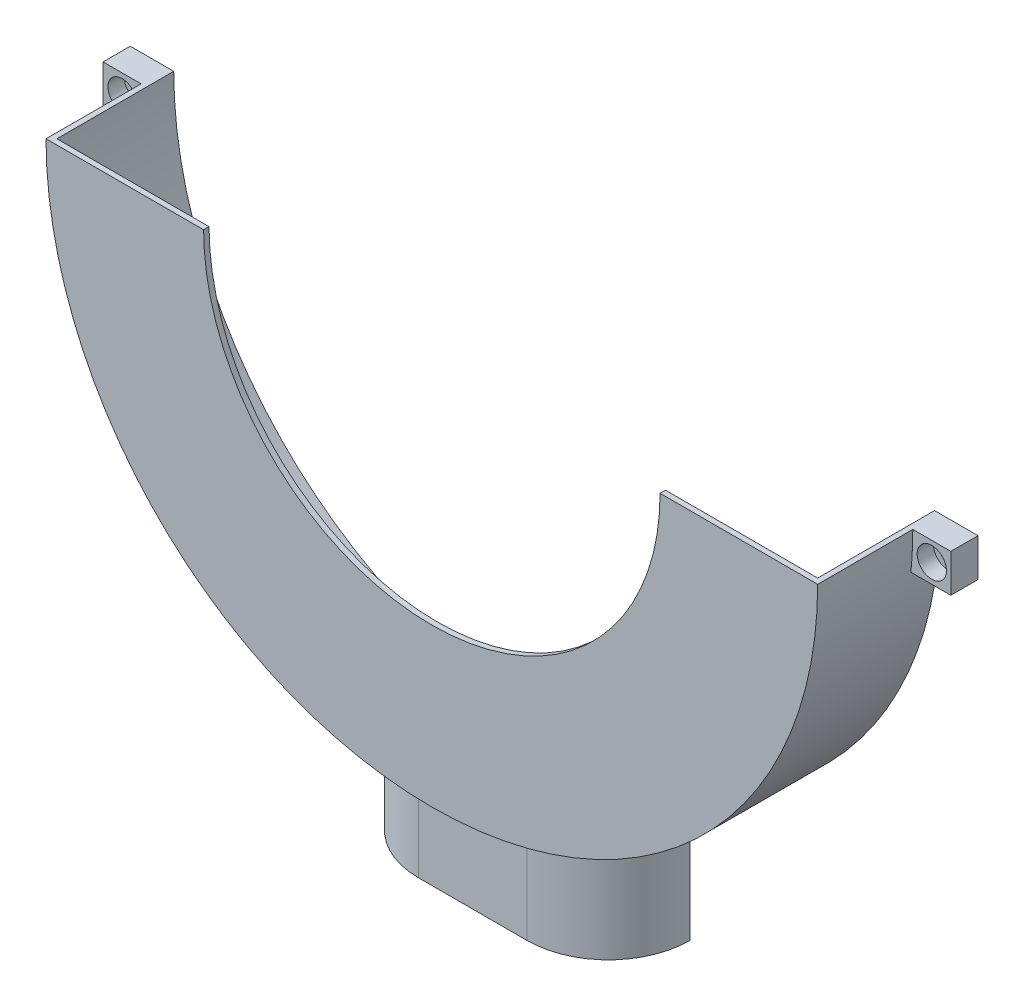
ISO-10303-21;
HEADER;
FILE_DESCRIPTION(('STEP AP214'),'2;1');
FILE_NAME('part.step','',(''),(''),'','','');
FILE_SCHEMA(('AUTOMOTIVE_DESIGN { 1 0 10303 214 1 1 1 1 }'));
ENDSEC;
DATA;
#1=APPLICATION_CONTEXT('core data for automotive mechanical design processes');
#2=APPLICATION_PROTOCOL_DEFINITION('international standard','automotive_design',2000,#1);
#3=PRODUCT_CONTEXT('',#1,'mechanical');
#4=PRODUCT('Part','Part','',(#3));
#5=PRODUCT_RELATED_PRODUCT_CATEGORY('part','',(#4));
#6=PRODUCT_DEFINITION_FORMATION('','',#4);
#7=PRODUCT_DEFINITION_CONTEXT('part definition',#1,'design');
#8=PRODUCT_DEFINITION('design','',#6,#7);
#9=PRODUCT_DEFINITION_SHAPE('','',#8);
#10=(LENGTH_UNIT() NAMED_UNIT(*) SI_UNIT(.MILLI.,.METRE.));
#11=(NAMED_UNIT(*) PLANE_ANGLE_UNIT() SI_UNIT($,.RADIAN.));
#12=(NAMED_UNIT(*) SI_UNIT($,.STERADIAN.) SOLID_ANGLE_UNIT());
#13=UNCERTAINTY_MEASURE_WITH_UNIT(LENGTH_MEASURE(1.E-05),#10,'distance_accuracy_value','');
#14=(GEOMETRIC_REPRESENTATION_CONTEXT(3) GLOBAL_UNCERTAINTY_ASSIGNED_CONTEXT((#13)) GLOBAL_UNIT_ASSIGNED_CONTEXT((#10,
#11,#12)) REPRESENTATION_CONTEXT('',''));
#15=CARTESIAN_POINT('',(0.,0.,0.));
#16=DIRECTION('',(0.,0.,1.));
#17=DIRECTION('',(1.,0.,0.));
#18=AXIS2_PLACEMENT_3D('',#15,#16,#17);
#19=CARTESIAN_POINT('',(0.,0.,0.));
#20=DIRECTION('',(0.,0.,1.));
#21=DIRECTION('',(1.,0.,0.));
#22=AXIS2_PLACEMENT_3D('',#19,#20,#21);
#23=PLANE('',#22);
#24=CARTESIAN_POINT('',(74.5,-3.49999999999999,0.));
#25=DIRECTION('',(0.,0.,-1.));
#26=DIRECTION('',(-1.,0.,0.));
#27=AXIS2_PLACEMENT_3D('',#24,#25,#26);
#28=CIRCLE('',#27,1.60000000000001);
#29=CARTESIAN_POINT('',(72.9,-3.49999999999999,0.));
#30=VERTEX_POINT('',#29);
#31=EDGE_CURVE('E336',#30,#30,#28,.T.);
#32=ORIENTED_EDGE('',*,*,#31,.F.);
#33=EDGE_LOOP('',(#32));
#34=FACE_BOUND('',#33,.T.);
#35=CARTESIAN_POINT('',(-74.5,-3.50000000000002,0.));
#36=DIRECTION('',(0.,0.,1.));
#37=DIRECTION('',(1.,0.,0.));
#38=AXIS2_PLACEMENT_3D('',#35,#36,#37);
#39=CIRCLE('',#38,1.60000000000001);
#40=CARTESIAN_POINT('',(-72.9,-3.50000000000002,0.));
#41=VERTEX_POINT('',#40);
#42=EDGE_CURVE('E354',#41,#41,#39,.T.);
#43=ORIENTED_EDGE('',*,*,#42,.T.);
#44=EDGE_LOOP('',(#43));
#45=FACE_BOUND('',#44,.T.);
#46=DIRECTION('',(0.,-1.,0.));
#47=VECTOR('',#46,1.);
#48=CARTESIAN_POINT('',(21.6189500386222,-71.,0.));
#49=LINE('',#48,#47);
#50=CARTESIAN_POINT('',(21.6189500386222,-71.,0.));
#51=VERTEX_POINT('',#50);
#52=CARTESIAN_POINT('',(21.6189500386222,-91.,0.));
#53=VERTEX_POINT('',#52);
#54=EDGE_CURVE('E302',#51,#53,#49,.T.);
#55=ORIENTED_EDGE('',*,*,#54,.F.);
#56=DIRECTION('',(1.,0.,0.));
#57=VECTOR('',#56,1.);
#58=CARTESIAN_POINT('',(0.,-71.,0.));
#59=LINE('',#58,#57);
#60=CARTESIAN_POINT('',(-21.6189500386223,-71.,0.));
#61=VERTEX_POINT('',#60);
#62=EDGE_CURVE('E268',#61,#51,#59,.T.);
#63=ORIENTED_EDGE('',*,*,#62,.F.);
#64=DIRECTION('',(0.,-1.,0.));
#65=VECTOR('',#64,1.);
#66=CARTESIAN_POINT('',(-21.6189500386223,-71.,0.));
#67=LINE('',#66,#65);
#68=CARTESIAN_POINT('',(-21.6189500386223,-91.,0.));
#69=VERTEX_POINT('',#68);
#70=EDGE_CURVE('E305',#61,#69,#67,.T.);
#71=ORIENTED_EDGE('',*,*,#70,.T.);
#72=DIRECTION('',(-1.,0.,0.));
#73=VECTOR('',#72,1.);
#74=CARTESIAN_POINT('',(0.,-91.,0.));
#75=LINE('',#74,#73);
#76=CARTESIAN_POINT('',(-25.,-91.,0.));
#77=VERTEX_POINT('',#76);
#78=EDGE_CURVE('E388',#69,#77,#75,.T.);
#79=ORIENTED_EDGE('',*,*,#78,.T.);
#80=DIRECTION('',(0.,1.,0.));
#81=VECTOR('',#80,1.);
#82=CARTESIAN_POINT('',(-25.,0.,0.));
#83=LINE('',#82,#81);
#84=CARTESIAN_POINT('',(-25.,-66.4529909033446,0.));
#85=VERTEX_POINT('',#84);
#86=EDGE_CURVE('E382',#77,#85,#83,.T.);
#87=ORIENTED_EDGE('',*,*,#86,.T.);
#88=CARTESIAN_POINT('',(0.,0.,0.));
#89=DIRECTION('',(0.,0.,1.));
#90=DIRECTION('',(1.,0.,0.));
#91=AXIS2_PLACEMENT_3D('',#88,#89,#90);
#92=CIRCLE('',#91,71.);
#93=CARTESIAN_POINT('',(-70.6540869306228,-7.00000000000003,0.));
#94=VERTEX_POINT('',#93);
#95=EDGE_CURVE('E428',#94,#85,#92,.T.);
#96=ORIENTED_EDGE('',*,*,#95,.F.);
#97=DIRECTION('',(1.,0.,0.));
#98=VECTOR('',#97,1.);
#99=CARTESIAN_POINT('',(-73.,-7.00000000000003,0.));
#100=LINE('',#99,#98);
#101=CARTESIAN_POINT('',(-78.,-7.00000000000003,0.));
#102=VERTEX_POINT('',#101);
#103=EDGE_CURVE('E363',#102,#94,#100,.T.);
#104=ORIENTED_EDGE('',*,*,#103,.F.);
#105=DIRECTION('',(0.,-1.,0.));
#106=VECTOR('',#105,1.);
#107=CARTESIAN_POINT('',(-78.,0.,0.));
#108=LINE('',#107,#106);
#109=CARTESIAN_POINT('',(-78.,0.,0.));
#110=VERTEX_POINT('',#109);
#111=EDGE_CURVE('E357',#110,#102,#108,.T.);
#112=ORIENTED_EDGE('',*,*,#111,.F.);
#113=DIRECTION('',(1.,0.,0.));
#114=VECTOR('',#113,1.);
#115=CARTESIAN_POINT('',(0.,0.,0.));
#116=LINE('',#115,#114);
#117=CARTESIAN_POINT('',(-70.,0.,0.));
#118=VERTEX_POINT('',#117);
#119=EDGE_CURVE('E424',#110,#118,#116,.T.);
#120=ORIENTED_EDGE('',*,*,#119,.T.);
#121=CARTESIAN_POINT('',(0.,0.,0.));
#122=DIRECTION('',(0.,0.,1.));
#123=DIRECTION('',(1.,0.,0.));
#124=AXIS2_PLACEMENT_3D('',#121,#122,#123);
#125=CIRCLE('',#124,70.);
#126=CARTESIAN_POINT('',(70.,0.,0.));
#127=VERTEX_POINT('',#126);
#128=EDGE_CURVE('E417',#118,#127,#125,.T.);
#129=ORIENTED_EDGE('',*,*,#128,.T.);
#130=CARTESIAN_POINT('',(78.,0.,0.));
#131=VERTEX_POINT('',#130);
#132=EDGE_CURVE('E422',#127,#131,#116,.T.);
#133=ORIENTED_EDGE('',*,*,#132,.T.);
#134=DIRECTION('',(0.,-1.,0.));
#135=VECTOR('',#134,1.);
#136=CARTESIAN_POINT('',(78.,0.,0.));
#137=LINE('',#136,#135);
#138=CARTESIAN_POINT('',(78.,-7.,0.));
#139=VERTEX_POINT('',#138);
#140=EDGE_CURVE('E329',#131,#139,#137,.T.);
#141=ORIENTED_EDGE('',*,*,#140,.T.);
#142=DIRECTION('',(-1.,0.,0.));
#143=VECTOR('',#142,1.);
#144=CARTESIAN_POINT('',(0.,-7.,0.));
#145=LINE('',#144,#143);
#146=CARTESIAN_POINT('',(70.6540869306228,-7.,0.));
#147=VERTEX_POINT('',#146);
#148=EDGE_CURVE('E339',#139,#147,#145,.T.);
#149=ORIENTED_EDGE('',*,*,#148,.T.);
#150=CARTESIAN_POINT('',(25.,-66.4529909033446,0.));
#151=VERTEX_POINT('',#150);
#152=EDGE_CURVE('E427',#151,#147,#92,.T.);
#153=ORIENTED_EDGE('',*,*,#152,.F.);
#154=DIRECTION('',(0.,1.,0.));
#155=VECTOR('',#154,1.);
#156=CARTESIAN_POINT('',(25.,0.,0.));
#157=LINE('',#156,#155);
#158=CARTESIAN_POINT('',(25.,-91.,0.));
#159=VERTEX_POINT('',#158);
#160=EDGE_CURVE('E385',#159,#151,#157,.T.);
#161=ORIENTED_EDGE('',*,*,#160,.F.);
#162=EDGE_CURVE('E389',#159,#53,#75,.T.);
#163=ORIENTED_EDGE('',*,*,#162,.T.);
#164=EDGE_LOOP('',(#55,#63,#71,#79,#87,#96,#104,#112,#120,#129,#133,#141,#149,#153,#161,#163));
#165=FACE_BOUND('',#164,.T.);
#166=ADVANCED_FACE('F105',(#34,#45,#165),#23,.F.);
#167=CARTESIAN_POINT('',(0.,-91.,15.));
#168=DIRECTION('',(0.,-1.,0.));
#169=DIRECTION('',(0.,0.,-1.));
#170=AXIS2_PLACEMENT_3D('',#167,#168,#169);
#171=PLANE('',#170);
#172=CARTESIAN_POINT('',(10.,-91.,0.));
#173=DIRECTION('',(0.,-1.,0.));
#174=DIRECTION('',(0.,0.,-1.));
#175=AXIS2_PLACEMENT_3D('',#172,#173,#174);
#176=CIRCLE('',#175,12.);
#177=CARTESIAN_POINT('',(21.6189500386222,-91.,3.));
#178=VERTEX_POINT('',#177);
#179=CARTESIAN_POINT('',(10.,-91.,12.));
#180=VERTEX_POINT('',#179);
#181=EDGE_CURVE('E293',#178,#180,#176,.T.);
#182=ORIENTED_EDGE('',*,*,#181,.F.);
#183=DIRECTION('',(0.,0.,-1.));
#184=VECTOR('',#183,1.);
#185=CARTESIAN_POINT('',(21.6189500386222,-91.,0.));
#186=LINE('',#185,#184);
#187=EDGE_CURVE('E126',#178,#53,#186,.T.);
#188=ORIENTED_EDGE('',*,*,#187,.T.);
#189=ORIENTED_EDGE('',*,*,#162,.F.);
#190=CARTESIAN_POINT('',(10.,-91.,0.));
#191=DIRECTION('',(0.,-1.,0.));
#192=DIRECTION('',(0.,0.,-1.));
#193=AXIS2_PLACEMENT_3D('',#190,#191,#192);
#194=CIRCLE('',#193,15.);
#195=CARTESIAN_POINT('',(10.,-91.,15.));
#196=VERTEX_POINT('',#195);
#197=EDGE_CURVE('E448',#159,#196,#194,.T.);
#198=ORIENTED_EDGE('',*,*,#197,.T.);
#199=DIRECTION('',(-1.,0.,0.));
#200=VECTOR('',#199,1.);
#201=CARTESIAN_POINT('',(0.,-91.,15.));
#202=LINE('',#201,#200);
#203=CARTESIAN_POINT('',(-10.,-91.,15.));
#204=VERTEX_POINT('',#203);
#205=EDGE_CURVE('E379',#196,#204,#202,.T.);
#206=ORIENTED_EDGE('',*,*,#205,.T.);
#207=CARTESIAN_POINT('',(-10.,-91.,0.));
#208=DIRECTION('',(0.,-1.,0.));
#209=DIRECTION('',(0.,0.,-1.));
#210=AXIS2_PLACEMENT_3D('',#207,#208,#209);
#211=CIRCLE('',#210,15.);
#212=EDGE_CURVE('E450',#204,#77,#211,.T.);
#213=ORIENTED_EDGE('',*,*,#212,.T.);
#214=ORIENTED_EDGE('',*,*,#78,.F.);
#215=DIRECTION('',(0.,0.,-1.));
#216=VECTOR('',#215,1.);
#217=CARTESIAN_POINT('',(-21.6189500386223,-91.,0.));
#218=LINE('',#217,#216);
#219=CARTESIAN_POINT('',(-21.6189500386223,-91.,3.));
#220=VERTEX_POINT('',#219);
#221=EDGE_CURVE('E278',#220,#69,#218,.T.);
#222=ORIENTED_EDGE('',*,*,#221,.F.);
#223=CARTESIAN_POINT('',(-10.,-91.,0.));
#224=DIRECTION('',(0.,-1.,0.));
#225=DIRECTION('',(0.,0.,-1.));
#226=AXIS2_PLACEMENT_3D('',#223,#224,#225);
#227=CIRCLE('',#226,12.);
#228=CARTESIAN_POINT('',(-10.,-91.,12.));
#229=VERTEX_POINT('',#228);
#230=EDGE_CURVE('E298',#229,#220,#227,.T.);
#231=ORIENTED_EDGE('',*,*,#230,.F.);
#232=DIRECTION('',(-1.,0.,0.));
#233=VECTOR('',#232,1.);
#234=CARTESIAN_POINT('',(0.,-91.,12.));
#235=LINE('',#234,#233);
#236=EDGE_CURVE('E295',#180,#229,#235,.T.);
#237=ORIENTED_EDGE('',*,*,#236,.F.);
#238=EDGE_LOOP('',(#182,#188,#189,#198,#206,#213,#214,#222,#231,#237));
#239=FACE_BOUND('',#238,.T.);
#240=ADVANCED_FACE('F478',(#239),#171,.T.);
#241=CARTESIAN_POINT('',(74.5,-3.49999999999999,5.));
#242=DIRECTION('',(0.,0.,-1.));
#243=DIRECTION('',(-1.,0.,0.));
#244=AXIS2_PLACEMENT_3D('',#241,#242,#243);
#245=CYLINDRICAL_SURFACE('',#244,1.60000000000001);
#246=ORIENTED_EDGE('',*,*,#31,.T.);
#247=EDGE_LOOP('',(#246));
#248=FACE_BOUND('',#247,.T.);
#249=CARTESIAN_POINT('',(74.5,-3.49999999999999,2.));
#250=DIRECTION('',(0.,0.,1.));
#251=DIRECTION('',(1.,0.,0.));
#252=AXIS2_PLACEMENT_3D('',#249,#250,#251);
#253=CIRCLE('',#252,1.60000000000001);
#254=CARTESIAN_POINT('',(76.1,-3.49999999999999,2.));
#255=VERTEX_POINT('',#254);
#256=EDGE_CURVE('E358',#255,#255,#253,.F.);
#257=ORIENTED_EDGE('',*,*,#256,.F.);
#258=EDGE_LOOP('',(#257));
#259=FACE_BOUND('',#258,.T.);
#260=ADVANCED_FACE('F484',(#248,#259),#245,.F.);
#261=CARTESIAN_POINT('',(-74.5,-3.50000000000002,5.));
#262=DIRECTION('',(0.,0.,-1.));
#263=DIRECTION('',(-1.,0.,0.));
#264=AXIS2_PLACEMENT_3D('',#261,#262,#263);
#265=CYLINDRICAL_SURFACE('',#264,1.60000000000001);
#266=ORIENTED_EDGE('',*,*,#42,.F.);
#267=EDGE_LOOP('',(#266));
#268=FACE_BOUND('',#267,.T.);
#269=CARTESIAN_POINT('',(-74.5,-3.50000000000002,2.));
#270=DIRECTION('',(0.,0.,1.));
#271=DIRECTION('',(1.,0.,0.));
#272=AXIS2_PLACEMENT_3D('',#269,#270,#271);
#273=CIRCLE('',#272,1.60000000000001);
#274=CARTESIAN_POINT('',(-72.9,-3.50000000000002,2.));
#275=VERTEX_POINT('',#274);
#276=EDGE_CURVE('E316',#275,#275,#273,.T.);
#277=ORIENTED_EDGE('',*,*,#276,.T.);
#278=EDGE_LOOP('',(#277));
#279=FACE_BOUND('',#278,.T.);
#280=ADVANCED_FACE('F475',(#268,#279),#265,.F.);
#281=CARTESIAN_POINT('',(0.,0.,21.5));
#282=DIRECTION('',(0.,0.,-1.));
#283=DIRECTION('',(-1.,0.,0.));
#284=AXIS2_PLACEMENT_3D('',#281,#282,#283);
#285=CYLINDRICAL_SURFACE('',#284,71.);
#286=ORIENTED_EDGE('',*,*,#95,.T.);
#287=CARTESIAN_POINT('',(-25.,-66.4529909033446,0.));
#288=CARTESIAN_POINT('',(-25.0000005903524,-66.4529892917345,0.202890123291094));
#289=CARTESIAN_POINT('',(-24.9958827959298,-66.4545399945073,0.405754132783713));
#290=CARTESIAN_POINT('',(-24.9794283711578,-66.4607272766142,0.811094434555971));
#291=CARTESIAN_POINT('',(-24.9670920257694,-66.4653637489557,1.01357074003433));
#292=CARTESIAN_POINT('',(-24.917797028508,-66.4838680768963,1.61974669485583));
#293=CARTESIAN_POINT('',(-24.8685523791685,-66.5023308782734,2.02238403361912));
#294=CARTESIAN_POINT('',(-24.737993198442,-66.5510066828299,2.82038996686675));
#295=CARTESIAN_POINT('',(-24.6567755820139,-66.5811841731827,3.21577678312238));
#296=CARTESIAN_POINT('',(-24.4630499639891,-66.6526056042619,3.99780486330627));
#297=CARTESIAN_POINT('',(-24.3505410103259,-66.6938498817037,4.38444586074817));
#298=CARTESIAN_POINT('',(-24.0953419993637,-66.7864723363784,5.14612284370514));
#299=CARTESIAN_POINT('',(-23.9526689943176,-66.8378447868793,5.52116524936546));
#300=CARTESIAN_POINT('',(-23.638324992462,-66.9496631926846,6.25750406523527));
#301=CARTESIAN_POINT('',(-23.4666523229956,-67.0101096713426,6.61879968107707));
#302=CARTESIAN_POINT('',(-23.0956020324913,-67.1388987831489,7.325612948941));
#303=CARTESIAN_POINT('',(-22.8962112994059,-67.2072451507505,7.67112303022247));
#304=CARTESIAN_POINT('',(-22.4712659315399,-67.3505194327208,8.34421645846842));
#305=CARTESIAN_POINT('',(-22.2457107012023,-67.4254474968928,8.67179939712486));
#306=CARTESIAN_POINT('',(-21.7615525631412,-67.5832961350776,9.31851766812734));
#307=CARTESIAN_POINT('',(-21.5020617801036,-67.6664058484265,9.63694224659087));
#308=CARTESIAN_POINT('',(-20.9583899157298,-67.8367677003514,10.2509462698629));
#309=CARTESIAN_POINT('',(-20.6742009101862,-67.9240211643104,10.5465183247368));
#310=CARTESIAN_POINT('',(-20.0829901748955,-68.1011653816012,11.1130988985723));
#311=CARTESIAN_POINT('',(-19.7759650826353,-68.1910565221346,11.3841037870398));
#312=CARTESIAN_POINT('',(-19.1410012430146,-68.3720048524889,11.8999762900218));
#313=CARTESIAN_POINT('',(-18.8130617028942,-68.4630620864058,12.1448429128263));
#314=CARTESIAN_POINT('',(-18.1218416025611,-68.6493487369842,12.6182231879232));
#315=CARTESIAN_POINT('',(-17.7576183066252,-68.744566193301,12.845366685592));
#316=CARTESIAN_POINT('',(-17.0108165521357,-68.9331587207391,13.2677206815555));
#317=CARTESIAN_POINT('',(-16.6282441960605,-69.0265343900152,13.4629417025938));
#318=CARTESIAN_POINT('',(-15.8472721857437,-69.2100050478546,13.8200473386814));
#319=CARTESIAN_POINT('',(-15.4488785608921,-69.3001012615813,13.9819445105397));
#320=CARTESIAN_POINT('',(-14.6388107248533,-69.4757285989762,14.2711708026575));
#321=CARTESIAN_POINT('',(-14.2271392023012,-69.5612606376462,14.3985068726197));
#322=CARTESIAN_POINT('',(-13.5009067949091,-69.7052730446685,14.5892427530184));
#323=CARTESIAN_POINT('',(-13.1886811773013,-69.7650412692188,14.660662313501));
#324=CARTESIAN_POINT('',(-12.559703961304,-69.881013679575,14.7834554064761));
#325=CARTESIAN_POINT('',(-12.242953253642,-69.9372185552684,14.8348328292425));
#326=CARTESIAN_POINT('',(-11.6062572804768,-70.045691676637,14.9172020304908));
#327=CARTESIAN_POINT('',(-11.2863131375469,-70.0979612540486,14.9482007330017));
#328=CARTESIAN_POINT('',(-10.6443571537927,-70.1983170317084,14.9896100135823));
#329=CARTESIAN_POINT('',(-10.3223447877684,-70.2464021202939,15.0000151365729));
#330=CARTESIAN_POINT('',(-10.,-70.2922470831599,15.));
#331=B_SPLINE_CURVE_WITH_KNOTS('',3,(#287,#288,#289,#290,#291,#292,#293,#294,#295,#296,#297,
#298,#299,#300,#301,#302,#303,#304,#305,#306,#307,#308,#309,#310,#311,#312,#313,#314,#315,#316,
#317,#318,#319,#320,#321,#322,#323,#324,#325,#326,#327,#328,#329,#330),.UNSPECIFIED.,.F.,.F.,(4,
2,2,2,2,2,2,2,2,2,2,2,2,2,2,2,2,2,2,2,2,4),(0.,0.608570725485435,1.21712035115968,
2.43364958759041,3.6465193843696,4.85942608782073,6.07164893913068,7.28394173351149,
8.4968099677002,9.70970581465124,10.9655839571441,12.2218665352263,13.4783344629911,
14.7348500453823,16.052339464034,17.3693937136526,18.6859507698999,20.0022428904329,
20.9790765747016,21.9557205564564,22.9320325344798,23.9086030953595),.UNSPECIFIED.);
#332=CARTESIAN_POINT('',(-10.,-70.2922470831599,15.));
#333=VERTEX_POINT('',#332);
#334=EDGE_CURVE('E119',#85,#333,#331,.T.);
#335=ORIENTED_EDGE('',*,*,#334,.T.);
#336=CARTESIAN_POINT('',(0.,0.,15.));
#337=DIRECTION('',(0.,0.,-1.));
#338=DIRECTION('',(-1.,0.,0.));
#339=AXIS2_PLACEMENT_3D('',#336,#337,#338);
#340=CIRCLE('',#339,71.);
#341=CARTESIAN_POINT('',(10.,-70.2922470831599,15.));
#342=VERTEX_POINT('',#341);
#343=EDGE_CURVE('E381',#342,#333,#340,.T.);
#344=ORIENTED_EDGE('',*,*,#343,.F.);
#345=CARTESIAN_POINT('',(10.,-70.2922470831599,15.));
#346=CARTESIAN_POINT('',(10.2139363859511,-70.2618131813049,14.9999999695141));
#347=CARTESIAN_POINT('',(10.4277051094957,-70.2304036050421,14.9954224227743));
#348=CARTESIAN_POINT('',(10.8545616919083,-70.1656971947847,14.9771615807701));
#349=CARTESIAN_POINT('',(11.0676495677583,-70.1324004082562,14.9634785144299));
#350=CARTESIAN_POINT('',(11.7051948561132,-70.0298043608516,14.9088613094986));
#351=CARTESIAN_POINT('',(12.1281307104455,-69.9577713905516,14.8543590709993));
#352=CARTESIAN_POINT('',(12.9658575720154,-69.8073592833812,14.7099992636987));
#353=CARTESIAN_POINT('',(13.38066245696,-69.7289923927318,14.6202086824519));
#354=CARTESIAN_POINT('',(14.2002005596321,-69.5667218100454,14.4061675282177));
#355=CARTESIAN_POINT('',(14.6049333766161,-69.482817898187,14.2819155864766));
#356=CARTESIAN_POINT('',(15.4014290237364,-69.3106193224046,14.0001054081002));
#357=CARTESIAN_POINT('',(15.7931979514005,-69.2223267730018,13.8425630946279));
#358=CARTESIAN_POINT('',(16.5614840552444,-69.0425442255805,13.4953562211368));
#359=CARTESIAN_POINT('',(16.938000614122,-68.9510540984265,13.3056903626025));
#360=CARTESIAN_POINT('',(17.6735305808308,-68.7661993899087,12.8955148799361));
#361=CARTESIAN_POINT('',(18.032537974225,-68.6728341797823,12.6749947565357));
#362=CARTESIAN_POINT('',(18.7306774207431,-68.4857090970559,12.2046075236882));
#363=CARTESIAN_POINT('',(19.0698091836421,-68.3919492187143,11.9547399858686));
#364=CARTESIAN_POINT('',(19.7333109621519,-68.2035043083046,11.4213751539266));
#365=CARTESIAN_POINT('',(20.0571892910213,-68.1088446037796,11.1372568191024));
#366=CARTESIAN_POINT('',(20.6797377755465,-67.9224119999273,10.541761974096));
#367=CARTESIAN_POINT('',(20.978408146774,-67.8306390759171,10.2303856970631));
#368=CARTESIAN_POINT('',(21.5484605400567,-67.6517045696799,9.58224126580219));
#369=CARTESIAN_POINT('',(21.8198378835186,-67.5645437792779,9.24546877538898));
#370=CARTESIAN_POINT('',(22.3331625384014,-67.3966082376737,8.5487036026553));
#371=CARTESIAN_POINT('',(22.5751109373863,-67.3158332505191,8.18871177917181));
#372=CARTESIAN_POINT('',(23.0255159856525,-67.1630975470954,7.45123442050554));
#373=CARTESIAN_POINT('',(23.2342590464413,-67.0910628877752,7.07393927329259));
#374=CARTESIAN_POINT('',(23.6190459412865,-66.9565697350019,6.30141160948439));
#375=CARTESIAN_POINT('',(23.795092157202,-66.8941105440649,5.90618040208504));
#376=CARTESIAN_POINT('',(24.1126449130714,-66.7803025975163,5.10100870037129));
#377=CARTESIAN_POINT('',(24.2541888866319,-66.7289418074986,4.69108470625582));
#378=CARTESIAN_POINT('',(24.5014780114503,-66.638539031647,3.85944868122548));
#379=CARTESIAN_POINT('',(24.60723609383,-66.5994925964062,3.43774096808075));
#380=CARTESIAN_POINT('',(24.7958654854792,-66.5295194123323,2.51729050082726));
#381=CARTESIAN_POINT('',(24.8723544259504,-66.5008961545058,2.01703122498264));
#382=CARTESIAN_POINT('',(24.9488991574379,-66.4721976200543,1.26268578907946));
#383=CARTESIAN_POINT('',(24.9680492680456,-66.4650041891141,1.01064489386477));
#384=CARTESIAN_POINT('',(24.9936017649907,-66.4553984058687,0.505754579709946));
#385=CARTESIAN_POINT('',(25.000000495831,-66.4529874245715,0.252904949727254));
#386=CARTESIAN_POINT('',(25.,-66.4529909033446,0.));
#387=B_SPLINE_CURVE_WITH_KNOTS('',3,(#345,#346,#347,#348,#349,#350,#351,#352,#353,#354,#355,
#356,#357,#358,#359,#360,#361,#362,#363,#364,#365,#366,#367,#368,#369,#370,#371,#372,#373,#374,
#375,#376,#377,#378,#379,#380,#381,#382,#383,#384,#385,#386),.UNSPECIFIED.,.F.,.F.,(4,2,2,2,2,2,
2,2,2,2,2,2,2,2,2,2,2,2,2,2,4),(0.,0.648163931239846,1.2963115674376,2.59201254012226,
3.88526568393931,5.17857020120226,6.47125751081972,7.76399708662323,9.05717763808697,
10.350377067933,11.6721482407039,12.9939081088883,14.31589416942,15.6378313603238,
16.9476628861356,18.2573989575104,19.5657076266864,20.8735430364311,22.3909334861488,
23.1492287751872,23.9077414170007),.UNSPECIFIED.);
#388=EDGE_CURVE('E12',#342,#151,#387,.T.);
#389=ORIENTED_EDGE('',*,*,#388,.T.);
#390=ORIENTED_EDGE('',*,*,#152,.T.);
#391=DIRECTION('',(0.,0.,-1.));
#392=VECTOR('',#391,1.);
#393=CARTESIAN_POINT('',(70.6540869306228,-7.,5.));
#394=LINE('',#393,#392);
#395=CARTESIAN_POINT('',(70.6540869306228,-7.,5.));
#396=VERTEX_POINT('',#395);
#397=EDGE_CURVE('E335',#396,#147,#394,.T.);
#398=ORIENTED_EDGE('',*,*,#397,.F.);
#399=CARTESIAN_POINT('',(0.,0.,5.));
#400=DIRECTION('',(0.,0.,-1.));
#401=DIRECTION('',(-1.,0.,0.));
#402=AXIS2_PLACEMENT_3D('',#399,#400,#401);
#403=CIRCLE('',#402,71.);
#404=CARTESIAN_POINT('',(71.,0.,5.));
#405=VERTEX_POINT('',#404);
#406=EDGE_CURVE('E378',#405,#396,#403,.T.);
#407=ORIENTED_EDGE('',*,*,#406,.F.);
#408=DIRECTION('',(0.,0.,-1.));
#409=VECTOR('',#408,1.);
#410=CARTESIAN_POINT('',(71.,0.,21.5));
#411=LINE('',#410,#409);
#412=CARTESIAN_POINT('',(71.,0.,22.5));
#413=VERTEX_POINT('',#412);
#414=EDGE_CURVE('E433',#413,#405,#411,.T.);
#415=ORIENTED_EDGE('',*,*,#414,.F.);
#416=CARTESIAN_POINT('',(0.,0.,22.5));
#417=DIRECTION('',(0.,0.,1.));
#418=DIRECTION('',(1.,0.,0.));
#419=AXIS2_PLACEMENT_3D('',#416,#417,#418);
#420=CIRCLE('',#419,71.);
#421=CARTESIAN_POINT('',(-71.,0.,22.5));
#422=VERTEX_POINT('',#421);
#423=EDGE_CURVE('E403',#422,#413,#420,.T.);
#424=ORIENTED_EDGE('',*,*,#423,.F.);
#425=DIRECTION('',(0.,0.,-1.));
#426=VECTOR('',#425,1.);
#427=CARTESIAN_POINT('',(-71.,0.,21.5));
#428=LINE('',#427,#426);
#429=CARTESIAN_POINT('',(-71.,0.,5.));
#430=VERTEX_POINT('',#429);
#431=EDGE_CURVE('E436',#422,#430,#428,.T.);
#432=ORIENTED_EDGE('',*,*,#431,.T.);
#433=CARTESIAN_POINT('',(-70.6540869306228,-7.00000000000003,5.));
#434=VERTEX_POINT('',#433);
#435=EDGE_CURVE('E347',#434,#430,#403,.T.);
#436=ORIENTED_EDGE('',*,*,#435,.F.);
#437=DIRECTION('',(0.,0.,-1.));
#438=VECTOR('',#437,1.);
#439=CARTESIAN_POINT('',(-70.6540869306228,-7.00000000000003,5.));
#440=LINE('',#439,#438);
#441=EDGE_CURVE('E351',#434,#94,#440,.T.);
#442=ORIENTED_EDGE('',*,*,#441,.T.);
#443=EDGE_LOOP('',(#286,#335,#344,#389,#390,#398,#407,#415,#424,#432,#436,#442));
#444=FACE_BOUND('',#443,.T.);
#445=ADVANCED_FACE('F456',(#444),#285,.T.);
#446=CARTESIAN_POINT('',(0.,0.,21.5));
#447=DIRECTION('',(0.,0.,-1.));
#448=DIRECTION('',(-1.,0.,0.));
#449=AXIS2_PLACEMENT_3D('',#446,#447,#448);
#450=CYLINDRICAL_SURFACE('',#449,70.);
#451=DIRECTION('',(0.,0.,-1.));
#452=VECTOR('',#451,1.);
#453=CARTESIAN_POINT('',(70.,0.,21.5));
#454=LINE('',#453,#452);
#455=CARTESIAN_POINT('',(70.,0.,21.5));
#456=VERTEX_POINT('',#455);
#457=EDGE_CURVE('E421',#456,#127,#454,.T.);
#458=ORIENTED_EDGE('',*,*,#457,.T.);
#459=ORIENTED_EDGE('',*,*,#128,.F.);
#460=DIRECTION('',(0.,0.,-1.));
#461=VECTOR('',#460,1.);
#462=CARTESIAN_POINT('',(-70.,0.,21.5));
#463=LINE('',#462,#461);
#464=CARTESIAN_POINT('',(-70.,0.,21.5));
#465=VERTEX_POINT('',#464);
#466=EDGE_CURVE('E438',#465,#118,#463,.T.);
#467=ORIENTED_EDGE('',*,*,#466,.F.);
#468=CARTESIAN_POINT('',(0.,0.,21.5));
#469=DIRECTION('',(0.,0.,1.));
#470=DIRECTION('',(1.,0.,0.));
#471=AXIS2_PLACEMENT_3D('',#468,#469,#470);
#472=CIRCLE('',#471,70.);
#473=EDGE_CURVE('E418',#465,#456,#472,.T.);
#474=ORIENTED_EDGE('',*,*,#473,.T.);
#475=EDGE_LOOP('',(#458,#459,#467,#474));
#476=FACE_BOUND('',#475,.T.);
#477=ADVANCED_FACE('F465',(#476),#450,.F.);
#478=CARTESIAN_POINT('',(0.,0.,21.5));
#479=DIRECTION('',(0.,1.,0.));
#480=DIRECTION('',(-1.,0.,0.));
#481=AXIS2_PLACEMENT_3D('',#478,#479,#480);
#482=PLANE('',#481);
#483=ORIENTED_EDGE('',*,*,#119,.F.);
#484=DIRECTION('',(0.,0.,-1.));
#485=VECTOR('',#484,1.);
#486=CARTESIAN_POINT('',(-78.,0.,5.));
#487=LINE('',#486,#485);
#488=CARTESIAN_POINT('',(-78.,0.,5.));
#489=VERTEX_POINT('',#488);
#490=EDGE_CURVE('E367',#489,#110,#487,.T.);
#491=ORIENTED_EDGE('',*,*,#490,.F.);
#492=DIRECTION('',(-1.,0.,0.));
#493=VECTOR('',#492,1.);
#494=CARTESIAN_POINT('',(-71.,-5.23545925731354E-13,5.));
#495=LINE('',#494,#493);
#496=EDGE_CURVE('E365',#430,#489,#495,.T.);
#497=ORIENTED_EDGE('',*,*,#496,.F.);
#498=ORIENTED_EDGE('',*,*,#431,.F.);
#499=DIRECTION('',(-1.,0.,0.));
#500=VECTOR('',#499,1.);
#501=CARTESIAN_POINT('',(0.,0.,22.5));
#502=LINE('',#501,#500);
#503=CARTESIAN_POINT('',(-42.,0.,22.5));
#504=VERTEX_POINT('',#503);
#505=EDGE_CURVE('E400',#504,#422,#502,.T.);
#506=ORIENTED_EDGE('',*,*,#505,.F.);
#507=DIRECTION('',(0.,0.,-1.));
#508=VECTOR('',#507,1.);
#509=CARTESIAN_POINT('',(-42.,0.,22.5));
#510=LINE('',#509,#508);
#511=CARTESIAN_POINT('',(-42.,0.,21.5));
#512=VERTEX_POINT('',#511);
#513=EDGE_CURVE('E406',#504,#512,#510,.T.);
#514=ORIENTED_EDGE('',*,*,#513,.T.);
#515=DIRECTION('',(-1.,0.,0.));
#516=VECTOR('',#515,1.);
#517=CARTESIAN_POINT('',(0.,0.,21.5));
#518=LINE('',#517,#516);
#519=EDGE_CURVE('E397',#512,#465,#518,.T.);
#520=ORIENTED_EDGE('',*,*,#519,.T.);
#521=ORIENTED_EDGE('',*,*,#466,.T.);
#522=EDGE_LOOP('',(#483,#491,#497,#498,#506,#514,#520,#521));
#523=FACE_BOUND('',#522,.T.);
#524=ADVANCED_FACE('F467',(#523),#482,.T.);
#525=ORIENTED_EDGE('',*,*,#132,.F.);
#526=ORIENTED_EDGE('',*,*,#457,.F.);
#527=DIRECTION('',(-1.,0.,0.));
#528=VECTOR('',#527,1.);
#529=CARTESIAN_POINT('',(0.,0.,21.5));
#530=LINE('',#529,#528);
#531=CARTESIAN_POINT('',(42.,0.,21.5));
#532=VERTEX_POINT('',#531);
#533=EDGE_CURVE('E384',#456,#532,#530,.T.);
#534=ORIENTED_EDGE('',*,*,#533,.T.);
#535=DIRECTION('',(0.,0.,-1.));
#536=VECTOR('',#535,1.);
#537=CARTESIAN_POINT('',(42.,0.,22.5));
#538=LINE('',#537,#536);
#539=CARTESIAN_POINT('',(42.,0.,22.5));
#540=VERTEX_POINT('',#539);
#541=EDGE_CURVE('E414',#540,#532,#538,.T.);
#542=ORIENTED_EDGE('',*,*,#541,.F.);
#543=DIRECTION('',(-1.,0.,0.));
#544=VECTOR('',#543,1.);
#545=CARTESIAN_POINT('',(0.,0.,22.5));
#546=LINE('',#545,#544);
#547=EDGE_CURVE('E394',#413,#540,#546,.T.);
#548=ORIENTED_EDGE('',*,*,#547,.F.);
#549=ORIENTED_EDGE('',*,*,#414,.T.);
#550=DIRECTION('',(1.,0.,0.));
#551=VECTOR('',#550,1.);
#552=CARTESIAN_POINT('',(0.,-5.51582605187271E-12,5.));
#553=LINE('',#552,#551);
#554=CARTESIAN_POINT('',(78.,0.,5.));
#555=VERTEX_POINT('',#554);
#556=EDGE_CURVE('E328',#405,#555,#553,.T.);
#557=ORIENTED_EDGE('',*,*,#556,.T.);
#558=DIRECTION('',(0.,0.,-1.));
#559=VECTOR('',#558,1.);
#560=CARTESIAN_POINT('',(78.,0.,5.));
#561=LINE('',#560,#559);
#562=EDGE_CURVE('E348',#555,#131,#561,.T.);
#563=ORIENTED_EDGE('',*,*,#562,.T.);
#564=EDGE_LOOP('',(#525,#526,#534,#542,#548,#549,#557,#563));
#565=FACE_BOUND('',#564,.T.);
#566=ADVANCED_FACE('F473',(#565),#482,.T.);
#567=CARTESIAN_POINT('',(0.,0.,21.5));
#568=DIRECTION('',(0.,0.,1.));
#569=DIRECTION('',(1.,0.,0.));
#570=AXIS2_PLACEMENT_3D('',#567,#568,#569);
#571=PLANE('',#570);
#572=ORIENTED_EDGE('',*,*,#473,.F.);
#573=ORIENTED_EDGE('',*,*,#519,.F.);
#574=CARTESIAN_POINT('',(0.,0.,21.5));
#575=DIRECTION('',(0.,0.,1.));
#576=DIRECTION('',(1.,0.,0.));
#577=AXIS2_PLACEMENT_3D('',#574,#575,#576);
#578=CIRCLE('',#577,42.);
#579=EDGE_CURVE('E408',#512,#532,#578,.T.);
#580=ORIENTED_EDGE('',*,*,#579,.T.);
#581=ORIENTED_EDGE('',*,*,#533,.F.);
#582=EDGE_LOOP('',(#572,#573,#580,#581));
#583=FACE_BOUND('',#582,.T.);
#584=ADVANCED_FACE('F493',(#583),#571,.F.);
#585=CARTESIAN_POINT('',(0.,0.,22.5));
#586=DIRECTION('',(0.,0.,-1.));
#587=DIRECTION('',(-1.,0.,0.));
#588=AXIS2_PLACEMENT_3D('',#585,#586,#587);
#589=CYLINDRICAL_SURFACE('',#588,42.);
#590=ORIENTED_EDGE('',*,*,#579,.F.);
#591=ORIENTED_EDGE('',*,*,#513,.F.);
#592=CARTESIAN_POINT('',(0.,0.,22.5));
#593=DIRECTION('',(0.,0.,1.));
#594=DIRECTION('',(1.,0.,0.));
#595=AXIS2_PLACEMENT_3D('',#592,#593,#594);
#596=CIRCLE('',#595,42.);
#597=EDGE_CURVE('E396',#504,#540,#596,.T.);
#598=ORIENTED_EDGE('',*,*,#597,.T.);
#599=ORIENTED_EDGE('',*,*,#541,.T.);
#600=EDGE_LOOP('',(#590,#591,#598,#599));
#601=FACE_BOUND('',#600,.T.);
#602=ADVANCED_FACE('F490',(#601),#589,.F.);
#603=CARTESIAN_POINT('',(0.,0.,22.5));
#604=DIRECTION('',(0.,0.,1.));
#605=DIRECTION('',(1.,0.,0.));
#606=AXIS2_PLACEMENT_3D('',#603,#604,#605);
#607=PLANE('',#606);
#608=ORIENTED_EDGE('',*,*,#547,.T.);
#609=ORIENTED_EDGE('',*,*,#597,.F.);
#610=ORIENTED_EDGE('',*,*,#505,.T.);
#611=ORIENTED_EDGE('',*,*,#423,.T.);
#612=EDGE_LOOP('',(#608,#609,#610,#611));
#613=FACE_BOUND('',#612,.T.);
#614=ADVANCED_FACE('F514',(#613),#607,.T.);
#615=CARTESIAN_POINT('',(0.,0.,15.));
#616=DIRECTION('',(0.,0.,-1.));
#617=DIRECTION('',(-1.,0.,0.));
#618=AXIS2_PLACEMENT_3D('',#615,#616,#617);
#619=PLANE('',#618);
#620=ORIENTED_EDGE('',*,*,#343,.T.);
#621=DIRECTION('',(0.,1.,0.));
#622=VECTOR('',#621,1.);
#623=CARTESIAN_POINT('',(-10.,-91.,15.));
#624=LINE('',#623,#622);
#625=EDGE_CURVE('E134',#333,#204,#624,.F.);
#626=ORIENTED_EDGE('',*,*,#625,.T.);
#627=ORIENTED_EDGE('',*,*,#205,.F.);
#628=DIRECTION('',(0.,1.,0.));
#629=VECTOR('',#628,1.);
#630=CARTESIAN_POINT('',(10.,0.,15.));
#631=LINE('',#630,#629);
#632=EDGE_CURVE('E440',#196,#342,#631,.T.);
#633=ORIENTED_EDGE('',*,*,#632,.T.);
#634=EDGE_LOOP('',(#620,#626,#627,#633));
#635=FACE_BOUND('',#634,.T.);
#636=ADVANCED_FACE('F537',(#635),#619,.F.);
#637=CARTESIAN_POINT('',(0.,-7.,5.));
#638=DIRECTION('',(0.,-1.,0.));
#639=DIRECTION('',(0.,0.,-1.));
#640=AXIS2_PLACEMENT_3D('',#637,#638,#639);
#641=PLANE('',#640);
#642=ORIENTED_EDGE('',*,*,#148,.F.);
#643=DIRECTION('',(0.,0.,-1.));
#644=VECTOR('',#643,1.);
#645=CARTESIAN_POINT('',(78.,-7.,5.));
#646=LINE('',#645,#644);
#647=CARTESIAN_POINT('',(78.,-7.,5.));
#648=VERTEX_POINT('',#647);
#649=EDGE_CURVE('E345',#648,#139,#646,.T.);
#650=ORIENTED_EDGE('',*,*,#649,.F.);
#651=DIRECTION('',(-1.,0.,0.));
#652=VECTOR('',#651,1.);
#653=CARTESIAN_POINT('',(0.,-7.,5.));
#654=LINE('',#653,#652);
#655=EDGE_CURVE('E325',#648,#396,#654,.T.);
#656=ORIENTED_EDGE('',*,*,#655,.T.);
#657=ORIENTED_EDGE('',*,*,#397,.T.);
#658=EDGE_LOOP('',(#642,#650,#656,#657));
#659=FACE_BOUND('',#658,.T.);
#660=ADVANCED_FACE('F525',(#659),#641,.T.);
#661=CARTESIAN_POINT('',(78.,0.,5.));
#662=DIRECTION('',(1.,0.,0.));
#663=DIRECTION('',(0.,0.,-1.));
#664=AXIS2_PLACEMENT_3D('',#661,#662,#663);
#665=PLANE('',#664);
#666=ORIENTED_EDGE('',*,*,#140,.F.);
#667=ORIENTED_EDGE('',*,*,#562,.F.);
#668=DIRECTION('',(0.,-1.,0.));
#669=VECTOR('',#668,1.);
#670=CARTESIAN_POINT('',(78.,0.,5.));
#671=LINE('',#670,#669);
#672=EDGE_CURVE('E332',#555,#648,#671,.T.);
#673=ORIENTED_EDGE('',*,*,#672,.T.);
#674=ORIENTED_EDGE('',*,*,#649,.T.);
#675=EDGE_LOOP('',(#666,#667,#673,#674));
#676=FACE_BOUND('',#675,.T.);
#677=ADVANCED_FACE('F527',(#676),#665,.T.);
#678=CARTESIAN_POINT('',(0.,0.,5.));
#679=DIRECTION('',(0.,0.,-1.));
#680=DIRECTION('',(-1.,0.,0.));
#681=AXIS2_PLACEMENT_3D('',#678,#679,#680);
#682=PLANE('',#681);
#683=CARTESIAN_POINT('',(74.5,-3.49999999999999,5.));
#684=DIRECTION('',(0.,0.,1.));
#685=DIRECTION('',(1.,0.,0.));
#686=AXIS2_PLACEMENT_3D('',#683,#684,#685);
#687=CIRCLE('',#686,2.7);
#688=CARTESIAN_POINT('',(77.2,-3.49999999999999,5.));
#689=VERTEX_POINT('',#688);
#690=EDGE_CURVE('E317',#689,#689,#687,.T.);
#691=ORIENTED_EDGE('',*,*,#690,.F.);
#692=EDGE_LOOP('',(#691));
#693=FACE_BOUND('',#692,.T.);
#694=ORIENTED_EDGE('',*,*,#556,.F.);
#695=ORIENTED_EDGE('',*,*,#406,.T.);
#696=ORIENTED_EDGE('',*,*,#655,.F.);
#697=ORIENTED_EDGE('',*,*,#672,.F.);
#698=EDGE_LOOP('',(#694,#695,#696,#697));
#699=FACE_BOUND('',#698,.T.);
#700=ADVANCED_FACE('F521',(#693,#699),#682,.F.);
#701=CARTESIAN_POINT('',(-74.5,-3.50000000000002,5.));
#702=DIRECTION('',(0.,0.,1.));
#703=DIRECTION('',(1.,0.,0.));
#704=AXIS2_PLACEMENT_3D('',#701,#702,#703);
#705=CIRCLE('',#704,2.6);
#706=CARTESIAN_POINT('',(-71.9,-3.50000000000002,5.));
#707=VERTEX_POINT('',#706);
#708=EDGE_CURVE('E320',#707,#707,#705,.T.);
#709=ORIENTED_EDGE('',*,*,#708,.F.);
#710=EDGE_LOOP('',(#709));
#711=FACE_BOUND('',#710,.T.);
#712=DIRECTION('',(-1.,0.,0.));
#713=VECTOR('',#712,1.);
#714=CARTESIAN_POINT('',(-73.,-7.00000000000003,5.));
#715=LINE('',#714,#713);
#716=CARTESIAN_POINT('',(-78.,-7.00000000000003,5.));
#717=VERTEX_POINT('',#716);
#718=EDGE_CURVE('E362',#434,#717,#715,.T.);
#719=ORIENTED_EDGE('',*,*,#718,.F.);
#720=ORIENTED_EDGE('',*,*,#435,.T.);
#721=ORIENTED_EDGE('',*,*,#496,.T.);
#722=DIRECTION('',(0.,-1.,0.));
#723=VECTOR('',#722,1.);
#724=CARTESIAN_POINT('',(-78.,0.,5.));
#725=LINE('',#724,#723);
#726=EDGE_CURVE('E359',#489,#717,#725,.T.);
#727=ORIENTED_EDGE('',*,*,#726,.T.);
#728=EDGE_LOOP('',(#719,#720,#721,#727));
#729=FACE_BOUND('',#728,.T.);
#730=ADVANCED_FACE('F534',(#711,#729),#682,.F.);
#731=CARTESIAN_POINT('',(-73.,-7.00000000000003,5.));
#732=DIRECTION('',(0.,1.,0.));
#733=DIRECTION('',(-1.,0.,0.));
#734=AXIS2_PLACEMENT_3D('',#731,#732,#733);
#735=PLANE('',#734);
#736=ORIENTED_EDGE('',*,*,#441,.F.);
#737=ORIENTED_EDGE('',*,*,#718,.T.);
#738=DIRECTION('',(0.,0.,-1.));
#739=VECTOR('',#738,1.);
#740=CARTESIAN_POINT('',(-78.,-7.00000000000003,5.));
#741=LINE('',#740,#739);
#742=EDGE_CURVE('E340',#717,#102,#741,.T.);
#743=ORIENTED_EDGE('',*,*,#742,.T.);
#744=ORIENTED_EDGE('',*,*,#103,.T.);
#745=EDGE_LOOP('',(#736,#737,#743,#744));
#746=FACE_BOUND('',#745,.T.);
#747=ADVANCED_FACE('F547',(#746),#735,.F.);
#748=CARTESIAN_POINT('',(-78.,0.,5.));
#749=DIRECTION('',(1.,0.,0.));
#750=DIRECTION('',(0.,0.,-1.));
#751=AXIS2_PLACEMENT_3D('',#748,#749,#750);
#752=PLANE('',#751);
#753=ORIENTED_EDGE('',*,*,#111,.T.);
#754=ORIENTED_EDGE('',*,*,#742,.F.);
#755=ORIENTED_EDGE('',*,*,#726,.F.);
#756=ORIENTED_EDGE('',*,*,#490,.T.);
#757=EDGE_LOOP('',(#753,#754,#755,#756));
#758=FACE_BOUND('',#757,.T.);
#759=ADVANCED_FACE('F550',(#758),#752,.F.);
#760=CARTESIAN_POINT('',(-74.5,-3.50000000000002,2.));
#761=DIRECTION('',(0.,0.,1.));
#762=DIRECTION('',(1.,0.,0.));
#763=AXIS2_PLACEMENT_3D('',#760,#761,#762);
#764=CYLINDRICAL_SURFACE('',#763,2.6);
#765=CARTESIAN_POINT('',(-74.5,-3.50000000000002,2.));
#766=DIRECTION('',(0.,0.,1.));
#767=DIRECTION('',(1.,0.,0.));
#768=AXIS2_PLACEMENT_3D('',#765,#766,#767);
#769=CIRCLE('',#768,2.6);
#770=CARTESIAN_POINT('',(-71.9,-3.50000000000002,2.));
#771=VERTEX_POINT('',#770);
#772=EDGE_CURVE('E304',#771,#771,#769,.T.);
#773=ORIENTED_EDGE('',*,*,#772,.F.);
#774=EDGE_LOOP('',(#773));
#775=FACE_BOUND('',#774,.T.);
#776=ORIENTED_EDGE('',*,*,#708,.T.);
#777=EDGE_LOOP('',(#776));
#778=FACE_BOUND('',#777,.T.);
#779=ADVANCED_FACE('F552',(#775,#778),#764,.F.);
#780=CARTESIAN_POINT('',(-74.5,-3.50000000000002,2.));
#781=DIRECTION('',(0.,0.,1.));
#782=DIRECTION('',(1.,0.,0.));
#783=AXIS2_PLACEMENT_3D('',#780,#781,#782);
#784=PLANE('',#783);
#785=ORIENTED_EDGE('',*,*,#276,.F.);
#786=EDGE_LOOP('',(#785));
#787=FACE_BOUND('',#786,.T.);
#788=ORIENTED_EDGE('',*,*,#772,.T.);
#789=EDGE_LOOP('',(#788));
#790=FACE_BOUND('',#789,.T.);
#791=ADVANCED_FACE('F726',(#787,#790),#784,.T.);
#792=CARTESIAN_POINT('',(74.5,-3.49999999999999,2.));
#793=DIRECTION('',(0.,0.,1.));
#794=DIRECTION('',(1.,0.,0.));
#795=AXIS2_PLACEMENT_3D('',#792,#793,#794);
#796=PLANE('',#795);
#797=CARTESIAN_POINT('',(74.5,-3.49999999999999,2.));
#798=DIRECTION('',(0.,0.,1.));
#799=DIRECTION('',(1.,0.,0.));
#800=AXIS2_PLACEMENT_3D('',#797,#798,#799);
#801=CIRCLE('',#800,2.7);
#802=CARTESIAN_POINT('',(77.2,-3.49999999999999,2.));
#803=VERTEX_POINT('',#802);
#804=EDGE_CURVE('E313',#803,#803,#801,.T.);
#805=ORIENTED_EDGE('',*,*,#804,.T.);
#806=EDGE_LOOP('',(#805));
#807=FACE_BOUND('',#806,.T.);
#808=ORIENTED_EDGE('',*,*,#256,.T.);
#809=EDGE_LOOP('',(#808));
#810=FACE_BOUND('',#809,.T.);
#811=ADVANCED_FACE('F737',(#807,#810),#796,.T.);
#812=CARTESIAN_POINT('',(74.5,-3.49999999999999,2.));
#813=DIRECTION('',(0.,0.,1.));
#814=DIRECTION('',(1.,0.,0.));
#815=AXIS2_PLACEMENT_3D('',#812,#813,#814);
#816=CYLINDRICAL_SURFACE('',#815,2.7);
#817=ORIENTED_EDGE('',*,*,#804,.F.);
#818=EDGE_LOOP('',(#817));
#819=FACE_BOUND('',#818,.T.);
#820=ORIENTED_EDGE('',*,*,#690,.T.);
#821=EDGE_LOOP('',(#820));
#822=FACE_BOUND('',#821,.T.);
#823=ADVANCED_FACE('F463',(#819,#822),#816,.F.);
#824=CARTESIAN_POINT('',(-10.,0.,0.));
#825=DIRECTION('',(0.,-1.,0.));
#826=DIRECTION('',(0.,0.,-1.));
#827=AXIS2_PLACEMENT_3D('',#824,#825,#826);
#828=CYLINDRICAL_SURFACE('',#827,15.);
#829=ORIENTED_EDGE('',*,*,#212,.F.);
#830=ORIENTED_EDGE('',*,*,#625,.F.);
#831=ORIENTED_EDGE('',*,*,#334,.F.);
#832=ORIENTED_EDGE('',*,*,#86,.F.);
#833=EDGE_LOOP('',(#829,#830,#831,#832));
#834=FACE_BOUND('',#833,.T.);
#835=ADVANCED_FACE('F460',(#834),#828,.T.);
#836=CARTESIAN_POINT('',(10.,0.,0.));
#837=DIRECTION('',(0.,1.,0.));
#838=DIRECTION('',(0.,0.,1.));
#839=AXIS2_PLACEMENT_3D('',#836,#837,#838);
#840=CYLINDRICAL_SURFACE('',#839,15.);
#841=ORIENTED_EDGE('',*,*,#197,.F.);
#842=ORIENTED_EDGE('',*,*,#160,.T.);
#843=ORIENTED_EDGE('',*,*,#388,.F.);
#844=ORIENTED_EDGE('',*,*,#632,.F.);
#845=EDGE_LOOP('',(#841,#842,#843,#844));
#846=FACE_BOUND('',#845,.T.);
#847=ADVANCED_FACE('F107',(#846),#840,.T.);
#848=CARTESIAN_POINT('',(21.6189500386222,-71.,0.));
#849=DIRECTION('',(-1.,0.,0.));
#850=DIRECTION('',(0.,0.,1.));
#851=AXIS2_PLACEMENT_3D('',#848,#849,#850);
#852=PLANE('',#851);
#853=ORIENTED_EDGE('',*,*,#187,.F.);
#854=DIRECTION('',(0.,-1.,0.));
#855=VECTOR('',#854,1.);
#856=CARTESIAN_POINT('',(21.6189500386222,-71.,3.));
#857=LINE('',#856,#855);
#858=CARTESIAN_POINT('',(21.6189500386222,-71.,3.));
#859=VERTEX_POINT('',#858);
#860=EDGE_CURVE('E258',#859,#178,#857,.T.);
#861=ORIENTED_EDGE('',*,*,#860,.F.);
#862=DIRECTION('',(0.,0.,-1.));
#863=VECTOR('',#862,1.);
#864=CARTESIAN_POINT('',(21.6189500386222,-71.,0.));
#865=LINE('',#864,#863);
#866=EDGE_CURVE('E261',#859,#51,#865,.T.);
#867=ORIENTED_EDGE('',*,*,#866,.T.);
#868=ORIENTED_EDGE('',*,*,#54,.T.);
#869=EDGE_LOOP('',(#853,#861,#867,#868));
#870=FACE_BOUND('',#869,.T.);
#871=ADVANCED_FACE('F260',(#870),#852,.T.);
#872=CARTESIAN_POINT('',(-21.6189500386223,-71.,0.));
#873=DIRECTION('',(-1.,0.,0.));
#874=DIRECTION('',(0.,0.,1.));
#875=AXIS2_PLACEMENT_3D('',#872,#873,#874);
#876=PLANE('',#875);
#877=ORIENTED_EDGE('',*,*,#221,.T.);
#878=ORIENTED_EDGE('',*,*,#70,.F.);
#879=DIRECTION('',(0.,0.,-1.));
#880=VECTOR('',#879,1.);
#881=CARTESIAN_POINT('',(-21.6189500386223,-71.,0.));
#882=LINE('',#881,#880);
#883=CARTESIAN_POINT('',(-21.6189500386223,-71.,3.));
#884=VERTEX_POINT('',#883);
#885=EDGE_CURVE('E289',#884,#61,#882,.T.);
#886=ORIENTED_EDGE('',*,*,#885,.F.);
#887=DIRECTION('',(0.,-1.,0.));
#888=VECTOR('',#887,1.);
#889=CARTESIAN_POINT('',(-21.6189500386223,-71.,3.));
#890=LINE('',#889,#888);
#891=EDGE_CURVE('E308',#884,#220,#890,.T.);
#892=ORIENTED_EDGE('',*,*,#891,.T.);
#893=EDGE_LOOP('',(#877,#878,#886,#892));
#894=FACE_BOUND('',#893,.T.);
#895=ADVANCED_FACE('F816',(#894),#876,.F.);
#896=CARTESIAN_POINT('',(-10.,-71.,0.));
#897=DIRECTION('',(0.,-1.,0.));
#898=DIRECTION('',(0.,0.,-1.));
#899=AXIS2_PLACEMENT_3D('',#896,#897,#898);
#900=CYLINDRICAL_SURFACE('',#899,12.);
#901=ORIENTED_EDGE('',*,*,#230,.T.);
#902=ORIENTED_EDGE('',*,*,#891,.F.);
#903=CARTESIAN_POINT('',(-10.,-71.,0.));
#904=DIRECTION('',(0.,-1.,0.));
#905=DIRECTION('',(0.,0.,-1.));
#906=AXIS2_PLACEMENT_3D('',#903,#904,#905);
#907=CIRCLE('',#906,12.);
#908=CARTESIAN_POINT('',(-10.,-71.,12.));
#909=VERTEX_POINT('',#908);
#910=EDGE_CURVE('E284',#909,#884,#907,.T.);
#911=ORIENTED_EDGE('',*,*,#910,.F.);
#912=DIRECTION('',(0.,-1.,0.));
#913=VECTOR('',#912,1.);
#914=CARTESIAN_POINT('',(-10.,-71.,12.));
#915=LINE('',#914,#913);
#916=EDGE_CURVE('E310',#909,#229,#915,.T.);
#917=ORIENTED_EDGE('',*,*,#916,.T.);
#918=EDGE_LOOP('',(#901,#902,#911,#917));
#919=FACE_BOUND('',#918,.T.);
#920=ADVANCED_FACE('F826',(#919),#900,.F.);
#921=CARTESIAN_POINT('',(0.,-71.,12.));
#922=DIRECTION('',(0.,0.,1.));
#923=DIRECTION('',(1.,0.,0.));
#924=AXIS2_PLACEMENT_3D('',#921,#922,#923);
#925=PLANE('',#924);
#926=ORIENTED_EDGE('',*,*,#236,.T.);
#927=ORIENTED_EDGE('',*,*,#916,.F.);
#928=DIRECTION('',(-1.,0.,0.));
#929=VECTOR('',#928,1.);
#930=CARTESIAN_POINT('',(0.,-71.,12.));
#931=LINE('',#930,#929);
#932=CARTESIAN_POINT('',(10.,-71.,12.));
#933=VERTEX_POINT('',#932);
#934=EDGE_CURVE('E282',#933,#909,#931,.T.);
#935=ORIENTED_EDGE('',*,*,#934,.F.);
#936=DIRECTION('',(0.,-1.,0.));
#937=VECTOR('',#936,1.);
#938=CARTESIAN_POINT('',(10.,-71.,12.));
#939=LINE('',#938,#937);
#940=EDGE_CURVE('E267',#933,#180,#939,.T.);
#941=ORIENTED_EDGE('',*,*,#940,.T.);
#942=EDGE_LOOP('',(#926,#927,#935,#941));
#943=FACE_BOUND('',#942,.T.);
#944=ADVANCED_FACE('F837',(#943),#925,.F.);
#945=CARTESIAN_POINT('',(10.,-71.,0.));
#946=DIRECTION('',(0.,-1.,0.));
#947=DIRECTION('',(0.,0.,-1.));
#948=AXIS2_PLACEMENT_3D('',#945,#946,#947);
#949=CYLINDRICAL_SURFACE('',#948,12.);
#950=ORIENTED_EDGE('',*,*,#181,.T.);
#951=ORIENTED_EDGE('',*,*,#940,.F.);
#952=CARTESIAN_POINT('',(10.,-71.,0.));
#953=DIRECTION('',(0.,-1.,0.));
#954=DIRECTION('',(0.,0.,-1.));
#955=AXIS2_PLACEMENT_3D('',#952,#953,#954);
#956=CIRCLE('',#955,12.);
#957=EDGE_CURVE('E274',#859,#933,#956,.T.);
#958=ORIENTED_EDGE('',*,*,#957,.F.);
#959=ORIENTED_EDGE('',*,*,#860,.T.);
#960=EDGE_LOOP('',(#950,#951,#958,#959));
#961=FACE_BOUND('',#960,.T.);
#962=ADVANCED_FACE('F280',(#961),#949,.F.);
#963=CARTESIAN_POINT('',(0.,-71.,0.));
#964=DIRECTION('',(0.,-1.,0.));
#965=DIRECTION('',(0.,0.,-1.));
#966=AXIS2_PLACEMENT_3D('',#963,#964,#965);
#967=PLANE('',#966);
#968=ORIENTED_EDGE('',*,*,#866,.F.);
#969=ORIENTED_EDGE('',*,*,#957,.T.);
#970=ORIENTED_EDGE('',*,*,#934,.T.);
#971=ORIENTED_EDGE('',*,*,#910,.T.);
#972=ORIENTED_EDGE('',*,*,#885,.T.);
#973=ORIENTED_EDGE('',*,*,#62,.T.);
#974=EDGE_LOOP('',(#968,#969,#970,#971,#972,#973));
#975=FACE_BOUND('',#974,.T.);
#976=ADVANCED_FACE('F272',(#975),#967,.T.);
#977=CLOSED_SHELL('',(#166,#240,#260,#280,#445,#477,#524,#566,#584,#602,#614,#636,#660,#677,
#700,#730,#747,#759,#779,#791,#811,#823,#835,#847,#871,#895,#920,#944,#962,#976));
#978=MANIFOLD_SOLID_BREP('B2',#977);
#979=ADVANCED_BREP_SHAPE_REPRESENTATION('',(#18,#978),#14);
#980=SHAPE_DEFINITION_REPRESENTATION(#9,#979);
ENDSEC;
END-ISO-10303-21;
